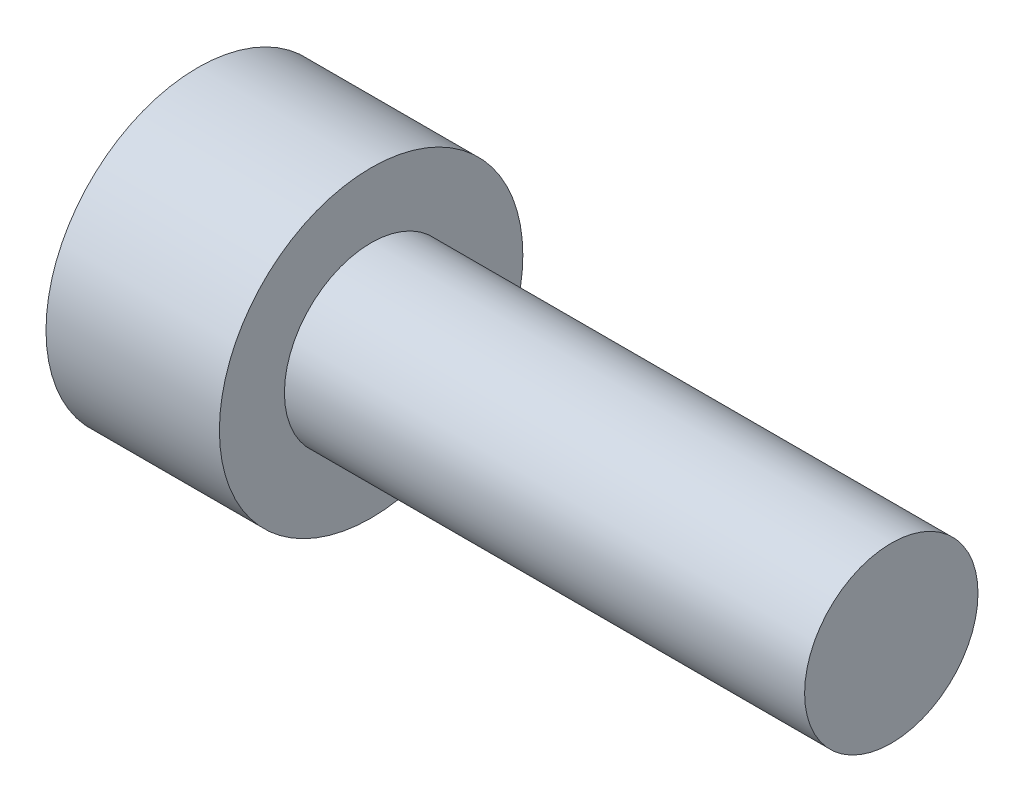
ISO-10303-21;
HEADER;
FILE_DESCRIPTION(('STEP AP214'),'2;1');
FILE_NAME('part.step','',(''),(''),'','','');
FILE_SCHEMA(('AUTOMOTIVE_DESIGN { 1 0 10303 214 1 1 1 1 }'));
ENDSEC;
DATA;
#1=APPLICATION_CONTEXT('core data for automotive mechanical design processes');
#2=APPLICATION_PROTOCOL_DEFINITION('international standard','automotive_design',2000,#1);
#3=PRODUCT_CONTEXT('',#1,'mechanical');
#4=PRODUCT('Part','Part','',(#3));
#5=PRODUCT_RELATED_PRODUCT_CATEGORY('part','',(#4));
#6=PRODUCT_DEFINITION_FORMATION('','',#4);
#7=PRODUCT_DEFINITION_CONTEXT('part definition',#1,'design');
#8=PRODUCT_DEFINITION('design','',#6,#7);
#9=PRODUCT_DEFINITION_SHAPE('','',#8);
#10=(LENGTH_UNIT() NAMED_UNIT(*) SI_UNIT(.MILLI.,.METRE.));
#11=(NAMED_UNIT(*) PLANE_ANGLE_UNIT() SI_UNIT($,.RADIAN.));
#12=(NAMED_UNIT(*) SI_UNIT($,.STERADIAN.) SOLID_ANGLE_UNIT());
#13=UNCERTAINTY_MEASURE_WITH_UNIT(LENGTH_MEASURE(1.E-05),#10,'distance_accuracy_value','');
#14=(GEOMETRIC_REPRESENTATION_CONTEXT(3) GLOBAL_UNCERTAINTY_ASSIGNED_CONTEXT((#13)) GLOBAL_UNIT_ASSIGNED_CONTEXT((#10,
#11,#12)) REPRESENTATION_CONTEXT('',''));
#15=CARTESIAN_POINT('',(0.,0.,0.));
#16=DIRECTION('',(0.,0.,1.));
#17=DIRECTION('',(1.,0.,0.));
#18=AXIS2_PLACEMENT_3D('',#15,#16,#17);
#19=CARTESIAN_POINT('',(0.,0.,0.));
#20=DIRECTION('',(-1.,0.,0.));
#21=DIRECTION('',(0.,0.,1.));
#22=AXIS2_PLACEMENT_3D('',#19,#20,#21);
#23=PLANE('',#22);
#24=DIRECTION('',(0.,-0.866025403784439,0.5));
#25=VECTOR('',#24,1.);
#26=CARTESIAN_POINT('',(0.,0.,-1.73205080756888));
#27=LINE('',#26,#25);
#28=CARTESIAN_POINT('',(0.,0.,-1.73205080756888));
#29=VERTEX_POINT('',#28);
#30=CARTESIAN_POINT('',(0.,-1.5,-0.866025403784439));
#31=VERTEX_POINT('',#30);
#32=EDGE_CURVE('E55',#29,#31,#27,.T.);
#33=ORIENTED_EDGE('',*,*,#32,.F.);
#34=DIRECTION('',(0.,-0.866025403784439,-0.5));
#35=VECTOR('',#34,1.);
#36=CARTESIAN_POINT('',(0.,1.5,-0.866025403784439));
#37=LINE('',#36,#35);
#38=CARTESIAN_POINT('',(0.,1.5,-0.866025403784439));
#39=VERTEX_POINT('',#38);
#40=EDGE_CURVE('E138',#39,#29,#37,.T.);
#41=ORIENTED_EDGE('',*,*,#40,.F.);
#42=DIRECTION('',(0.,0.,-1.));
#43=VECTOR('',#42,1.);
#44=CARTESIAN_POINT('',(0.,1.5,0.866025403784439));
#45=LINE('',#44,#43);
#46=CARTESIAN_POINT('',(0.,1.5,0.866025403784439));
#47=VERTEX_POINT('',#46);
#48=EDGE_CURVE('E136',#47,#39,#45,.T.);
#49=ORIENTED_EDGE('',*,*,#48,.F.);
#50=DIRECTION('',(0.,0.866025403784439,-0.5));
#51=VECTOR('',#50,1.);
#52=CARTESIAN_POINT('',(0.,0.,1.73205080756888));
#53=LINE('',#52,#51);
#54=CARTESIAN_POINT('',(0.,0.,1.73205080756888));
#55=VERTEX_POINT('',#54);
#56=EDGE_CURVE('E103',#55,#47,#53,.T.);
#57=ORIENTED_EDGE('',*,*,#56,.F.);
#58=DIRECTION('',(0.,0.866025403784438,0.5));
#59=VECTOR('',#58,1.);
#60=CARTESIAN_POINT('',(0.,-1.5,0.866025403784439));
#61=LINE('',#60,#59);
#62=CARTESIAN_POINT('',(0.,-1.5,0.866025403784439));
#63=VERTEX_POINT('',#62);
#64=EDGE_CURVE('E132',#63,#55,#61,.T.);
#65=ORIENTED_EDGE('',*,*,#64,.F.);
#66=DIRECTION('',(0.,0.,1.));
#67=VECTOR('',#66,1.);
#68=CARTESIAN_POINT('',(0.,-1.5,-0.866025403784439));
#69=LINE('',#68,#67);
#70=EDGE_CURVE('E129',#31,#63,#69,.T.);
#71=ORIENTED_EDGE('',*,*,#70,.F.);
#72=EDGE_LOOP('',(#33,#41,#49,#57,#65,#71));
#73=FACE_BOUND('',#72,.T.);
#74=CARTESIAN_POINT('',(0.,0.,0.));
#75=DIRECTION('',(1.,0.,0.));
#76=DIRECTION('',(0.,0.,-1.));
#77=AXIS2_PLACEMENT_3D('',#74,#75,#76);
#78=CIRCLE('',#77,3.5);
#79=CARTESIAN_POINT('',(0.,0.,-3.5));
#80=VERTEX_POINT('',#79);
#81=EDGE_CURVE('E11',#80,#80,#78,.T.);
#82=ORIENTED_EDGE('',*,*,#81,.F.);
#83=EDGE_LOOP('',(#82));
#84=FACE_BOUND('',#83,.T.);
#85=ADVANCED_FACE('F41',(#73,#84),#23,.T.);
#86=CARTESIAN_POINT('',(16.,0.,0.));
#87=DIRECTION('',(1.,0.,0.));
#88=DIRECTION('',(0.,0.,-1.));
#89=AXIS2_PLACEMENT_3D('',#86,#87,#88);
#90=CYLINDRICAL_SURFACE('',#89,3.5);
#91=ORIENTED_EDGE('',*,*,#81,.T.);
#92=EDGE_LOOP('',(#91));
#93=FACE_BOUND('',#92,.T.);
#94=CARTESIAN_POINT('',(4.,0.,0.));
#95=DIRECTION('',(1.,0.,0.));
#96=DIRECTION('',(0.,0.,-1.));
#97=AXIS2_PLACEMENT_3D('',#94,#95,#96);
#98=CIRCLE('',#97,3.5);
#99=CARTESIAN_POINT('',(4.,0.,-3.5));
#100=VERTEX_POINT('',#99);
#101=EDGE_CURVE('E48',#100,#100,#98,.T.);
#102=ORIENTED_EDGE('',*,*,#101,.F.);
#103=EDGE_LOOP('',(#102));
#104=FACE_BOUND('',#103,.T.);
#105=ADVANCED_FACE('F158',(#93,#104),#90,.T.);
#106=CARTESIAN_POINT('',(4.,3.5,0.));
#107=DIRECTION('',(1.,0.,0.));
#108=DIRECTION('',(0.,0.,-1.));
#109=AXIS2_PLACEMENT_3D('',#106,#107,#108);
#110=PLANE('',#109);
#111=ORIENTED_EDGE('',*,*,#101,.T.);
#112=EDGE_LOOP('',(#111));
#113=FACE_BOUND('',#112,.T.);
#114=CARTESIAN_POINT('',(4.,0.,0.));
#115=DIRECTION('',(1.,0.,0.));
#116=DIRECTION('',(0.,0.,-1.));
#117=AXIS2_PLACEMENT_3D('',#114,#115,#116);
#118=CIRCLE('',#117,2.);
#119=CARTESIAN_POINT('',(4.,0.,-2.));
#120=VERTEX_POINT('',#119);
#121=EDGE_CURVE('E150',#120,#120,#118,.T.);
#122=ORIENTED_EDGE('',*,*,#121,.F.);
#123=EDGE_LOOP('',(#122));
#124=FACE_BOUND('',#123,.T.);
#125=ADVANCED_FACE('F155',(#113,#124),#110,.T.);
#126=CARTESIAN_POINT('',(16.,0.,0.));
#127=DIRECTION('',(1.,0.,0.));
#128=DIRECTION('',(0.,0.,-1.));
#129=AXIS2_PLACEMENT_3D('',#126,#127,#128);
#130=CYLINDRICAL_SURFACE('',#129,2.);
#131=ORIENTED_EDGE('',*,*,#121,.T.);
#132=EDGE_LOOP('',(#131));
#133=FACE_BOUND('',#132,.T.);
#134=CARTESIAN_POINT('',(16.,0.,0.));
#135=DIRECTION('',(1.,0.,0.));
#136=DIRECTION('',(0.,0.,-1.));
#137=AXIS2_PLACEMENT_3D('',#134,#135,#136);
#138=CIRCLE('',#137,2.);
#139=CARTESIAN_POINT('',(16.,0.,-2.));
#140=VERTEX_POINT('',#139);
#141=EDGE_CURVE('E142',#140,#140,#138,.T.);
#142=ORIENTED_EDGE('',*,*,#141,.F.);
#143=EDGE_LOOP('',(#142));
#144=FACE_BOUND('',#143,.T.);
#145=ADVANCED_FACE('F165',(#133,#144),#130,.T.);
#146=CARTESIAN_POINT('',(16.,2.,0.));
#147=DIRECTION('',(1.,0.,0.));
#148=DIRECTION('',(0.,0.,-1.));
#149=AXIS2_PLACEMENT_3D('',#146,#147,#148);
#150=PLANE('',#149);
#151=ORIENTED_EDGE('',*,*,#141,.T.);
#152=EDGE_LOOP('',(#151));
#153=FACE_BOUND('',#152,.T.);
#154=ADVANCED_FACE('F171',(#153),#150,.T.);
#155=CARTESIAN_POINT('',(2.,0.,-1.73205080756888));
#156=DIRECTION('',(0.,-0.5,-0.866025403784439));
#157=DIRECTION('',(0.,0.866025403784439,-0.5));
#158=AXIS2_PLACEMENT_3D('',#155,#156,#157);
#159=PLANE('',#158);
#160=ORIENTED_EDGE('',*,*,#32,.T.);
#161=DIRECTION('',(-1.,0.,0.));
#162=VECTOR('',#161,1.);
#163=CARTESIAN_POINT('',(2.,-1.5,-0.866025403784439));
#164=LINE('',#163,#162);
#165=CARTESIAN_POINT('',(2.,-1.5,-0.866025403784439));
#166=VERTEX_POINT('',#165);
#167=EDGE_CURVE('E85',#166,#31,#164,.T.);
#168=ORIENTED_EDGE('',*,*,#167,.F.);
#169=DIRECTION('',(0.,-0.866025403784439,0.5));
#170=VECTOR('',#169,1.);
#171=CARTESIAN_POINT('',(2.,0.,-1.73205080756888));
#172=LINE('',#171,#170);
#173=CARTESIAN_POINT('',(2.,0.,-1.73205080756888));
#174=VERTEX_POINT('',#173);
#175=EDGE_CURVE('E140',#174,#166,#172,.T.);
#176=ORIENTED_EDGE('',*,*,#175,.F.);
#177=DIRECTION('',(-1.,0.,0.));
#178=VECTOR('',#177,1.);
#179=CARTESIAN_POINT('',(2.,0.,-1.73205080756888));
#180=LINE('',#179,#178);
#181=EDGE_CURVE('E63',#174,#29,#180,.T.);
#182=ORIENTED_EDGE('',*,*,#181,.T.);
#183=EDGE_LOOP('',(#160,#168,#176,#182));
#184=FACE_BOUND('',#183,.T.);
#185=ADVANCED_FACE('F175',(#184),#159,.F.);
#186=CARTESIAN_POINT('',(2.,1.5,-0.866025403784439));
#187=DIRECTION('',(0.,0.5,-0.866025403784439));
#188=DIRECTION('',(0.,0.866025403784439,0.5));
#189=AXIS2_PLACEMENT_3D('',#186,#187,#188);
#190=PLANE('',#189);
#191=ORIENTED_EDGE('',*,*,#40,.T.);
#192=ORIENTED_EDGE('',*,*,#181,.F.);
#193=DIRECTION('',(0.,-0.866025403784439,-0.5));
#194=VECTOR('',#193,1.);
#195=CARTESIAN_POINT('',(2.,1.5,-0.866025403784439));
#196=LINE('',#195,#194);
#197=CARTESIAN_POINT('',(2.,1.5,-0.866025403784439));
#198=VERTEX_POINT('',#197);
#199=EDGE_CURVE('E115',#198,#174,#196,.T.);
#200=ORIENTED_EDGE('',*,*,#199,.F.);
#201=DIRECTION('',(-1.,0.,0.));
#202=VECTOR('',#201,1.);
#203=CARTESIAN_POINT('',(2.,1.5,-0.866025403784439));
#204=LINE('',#203,#202);
#205=EDGE_CURVE('E107',#198,#39,#204,.T.);
#206=ORIENTED_EDGE('',*,*,#205,.T.);
#207=EDGE_LOOP('',(#191,#192,#200,#206));
#208=FACE_BOUND('',#207,.T.);
#209=ADVANCED_FACE('F179',(#208),#190,.F.);
#210=CARTESIAN_POINT('',(2.,1.5,0.866025403784439));
#211=DIRECTION('',(0.,1.,0.));
#212=DIRECTION('',(0.,0.,1.));
#213=AXIS2_PLACEMENT_3D('',#210,#211,#212);
#214=PLANE('',#213);
#215=ORIENTED_EDGE('',*,*,#48,.T.);
#216=ORIENTED_EDGE('',*,*,#205,.F.);
#217=DIRECTION('',(0.,0.,-1.));
#218=VECTOR('',#217,1.);
#219=CARTESIAN_POINT('',(2.,1.5,0.866025403784439));
#220=LINE('',#219,#218);
#221=CARTESIAN_POINT('',(2.,1.5,0.866025403784439));
#222=VERTEX_POINT('',#221);
#223=EDGE_CURVE('E111',#222,#198,#220,.T.);
#224=ORIENTED_EDGE('',*,*,#223,.F.);
#225=DIRECTION('',(-1.,0.,0.));
#226=VECTOR('',#225,1.);
#227=CARTESIAN_POINT('',(2.,1.5,0.866025403784439));
#228=LINE('',#227,#226);
#229=EDGE_CURVE('E96',#222,#47,#228,.T.);
#230=ORIENTED_EDGE('',*,*,#229,.T.);
#231=EDGE_LOOP('',(#215,#216,#224,#230));
#232=FACE_BOUND('',#231,.T.);
#233=ADVANCED_FACE('F112',(#232),#214,.F.);
#234=CARTESIAN_POINT('',(2.,0.,1.73205080756888));
#235=DIRECTION('',(0.,0.5,0.866025403784439));
#236=DIRECTION('',(0.,-0.866025403784439,0.5));
#237=AXIS2_PLACEMENT_3D('',#234,#235,#236);
#238=PLANE('',#237);
#239=ORIENTED_EDGE('',*,*,#56,.T.);
#240=ORIENTED_EDGE('',*,*,#229,.F.);
#241=DIRECTION('',(0.,0.866025403784439,-0.5));
#242=VECTOR('',#241,1.);
#243=CARTESIAN_POINT('',(2.,0.,1.73205080756888));
#244=LINE('',#243,#242);
#245=CARTESIAN_POINT('',(2.,0.,1.73205080756888));
#246=VERTEX_POINT('',#245);
#247=EDGE_CURVE('E100',#246,#222,#244,.T.);
#248=ORIENTED_EDGE('',*,*,#247,.F.);
#249=DIRECTION('',(-1.,0.,0.));
#250=VECTOR('',#249,1.);
#251=CARTESIAN_POINT('',(2.,0.,1.73205080756888));
#252=LINE('',#251,#250);
#253=EDGE_CURVE('E108',#246,#55,#252,.T.);
#254=ORIENTED_EDGE('',*,*,#253,.T.);
#255=EDGE_LOOP('',(#239,#240,#248,#254));
#256=FACE_BOUND('',#255,.T.);
#257=ADVANCED_FACE('F98',(#256),#238,.F.);
#258=CARTESIAN_POINT('',(2.,-1.5,0.866025403784439));
#259=DIRECTION('',(0.,-0.5,0.866025403784438));
#260=DIRECTION('',(0.,-0.866025403784438,-0.5));
#261=AXIS2_PLACEMENT_3D('',#258,#259,#260);
#262=PLANE('',#261);
#263=ORIENTED_EDGE('',*,*,#64,.T.);
#264=ORIENTED_EDGE('',*,*,#253,.F.);
#265=DIRECTION('',(0.,0.866025403784438,0.5));
#266=VECTOR('',#265,1.);
#267=CARTESIAN_POINT('',(2.,-1.5,0.866025403784439));
#268=LINE('',#267,#266);
#269=CARTESIAN_POINT('',(2.,-1.5,0.866025403784439));
#270=VERTEX_POINT('',#269);
#271=EDGE_CURVE('E121',#270,#246,#268,.T.);
#272=ORIENTED_EDGE('',*,*,#271,.F.);
#273=DIRECTION('',(-1.,0.,0.));
#274=VECTOR('',#273,1.);
#275=CARTESIAN_POINT('',(2.,-1.5,0.866025403784439));
#276=LINE('',#275,#274);
#277=EDGE_CURVE('E145',#270,#63,#276,.T.);
#278=ORIENTED_EDGE('',*,*,#277,.T.);
#279=EDGE_LOOP('',(#263,#264,#272,#278));
#280=FACE_BOUND('',#279,.T.);
#281=ADVANCED_FACE('F183',(#280),#262,.F.);
#282=CARTESIAN_POINT('',(2.,-1.5,-0.866025403784439));
#283=DIRECTION('',(0.,-1.,0.));
#284=DIRECTION('',(0.,0.,-1.));
#285=AXIS2_PLACEMENT_3D('',#282,#283,#284);
#286=PLANE('',#285);
#287=ORIENTED_EDGE('',*,*,#70,.T.);
#288=ORIENTED_EDGE('',*,*,#277,.F.);
#289=DIRECTION('',(0.,0.,1.));
#290=VECTOR('',#289,1.);
#291=CARTESIAN_POINT('',(2.,-1.5,-0.866025403784439));
#292=LINE('',#291,#290);
#293=EDGE_CURVE('E123',#166,#270,#292,.T.);
#294=ORIENTED_EDGE('',*,*,#293,.F.);
#295=ORIENTED_EDGE('',*,*,#167,.T.);
#296=EDGE_LOOP('',(#287,#288,#294,#295));
#297=FACE_BOUND('',#296,.T.);
#298=ADVANCED_FACE('F180',(#297),#286,.F.);
#299=CARTESIAN_POINT('',(2.,0.,0.));
#300=DIRECTION('',(-1.,0.,0.));
#301=DIRECTION('',(0.,0.,1.));
#302=AXIS2_PLACEMENT_3D('',#299,#300,#301);
#303=PLANE('',#302);
#304=ORIENTED_EDGE('',*,*,#175,.T.);
#305=ORIENTED_EDGE('',*,*,#293,.T.);
#306=ORIENTED_EDGE('',*,*,#271,.T.);
#307=ORIENTED_EDGE('',*,*,#247,.T.);
#308=ORIENTED_EDGE('',*,*,#223,.T.);
#309=ORIENTED_EDGE('',*,*,#199,.T.);
#310=EDGE_LOOP('',(#304,#305,#306,#307,#308,#309));
#311=FACE_BOUND('',#310,.T.);
#312=ADVANCED_FACE('F118',(#311),#303,.T.);
#313=CLOSED_SHELL('',(#85,#105,#125,#145,#154,#185,#209,#233,#257,#281,#298,#312));
#314=MANIFOLD_SOLID_BREP('B2',#313);
#315=ADVANCED_BREP_SHAPE_REPRESENTATION('',(#18,#314),#14);
#316=SHAPE_DEFINITION_REPRESENTATION(#9,#315);
ENDSEC;
END-ISO-10303-21;
